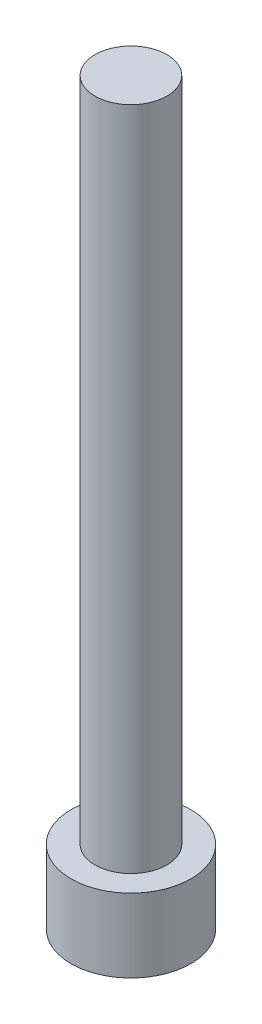
ISO-10303-21;
HEADER;
FILE_DESCRIPTION(('STEP AP214'),'2;1');
FILE_NAME('part.step','',(''),(''),'','','');
FILE_SCHEMA(('AUTOMOTIVE_DESIGN { 1 0 10303 214 1 1 1 1 }'));
ENDSEC;
DATA;
#1=APPLICATION_CONTEXT('core data for automotive mechanical design processes');
#2=APPLICATION_PROTOCOL_DEFINITION('international standard','automotive_design',2000,#1);
#3=PRODUCT_CONTEXT('',#1,'mechanical');
#4=PRODUCT('Part','Part','',(#3));
#5=PRODUCT_RELATED_PRODUCT_CATEGORY('part','',(#4));
#6=PRODUCT_DEFINITION_FORMATION('','',#4);
#7=PRODUCT_DEFINITION_CONTEXT('part definition',#1,'design');
#8=PRODUCT_DEFINITION('design','',#6,#7);
#9=PRODUCT_DEFINITION_SHAPE('','',#8);
#10=(LENGTH_UNIT() NAMED_UNIT(*) SI_UNIT(.MILLI.,.METRE.));
#11=(NAMED_UNIT(*) PLANE_ANGLE_UNIT() SI_UNIT($,.RADIAN.));
#12=(NAMED_UNIT(*) SI_UNIT($,.STERADIAN.) SOLID_ANGLE_UNIT());
#13=UNCERTAINTY_MEASURE_WITH_UNIT(LENGTH_MEASURE(1.E-05),#10,'distance_accuracy_value','');
#14=(GEOMETRIC_REPRESENTATION_CONTEXT(3) GLOBAL_UNCERTAINTY_ASSIGNED_CONTEXT((#13)) GLOBAL_UNIT_ASSIGNED_CONTEXT((#10,
#11,#12)) REPRESENTATION_CONTEXT('',''));
#15=CARTESIAN_POINT('',(0.,0.,0.));
#16=DIRECTION('',(0.,0.,1.));
#17=DIRECTION('',(1.,0.,0.));
#18=AXIS2_PLACEMENT_3D('',#15,#16,#17);
#19=CARTESIAN_POINT('',(0.,3.5052,0.));
#20=DIRECTION('',(0.,1.,0.));
#21=DIRECTION('',(0.,0.,1.));
#22=AXIS2_PLACEMENT_3D('',#19,#20,#21);
#23=PLANE('',#22);
#24=CARTESIAN_POINT('',(0.,3.5052,0.));
#25=DIRECTION('',(0.,1.,0.));
#26=DIRECTION('',(0.,0.,1.));
#27=AXIS2_PLACEMENT_3D('',#24,#25,#26);
#28=CIRCLE('',#27,2.8575);
#29=CARTESIAN_POINT('',(0.,3.5052,2.8575));
#30=VERTEX_POINT('',#29);
#31=EDGE_CURVE('E11',#30,#30,#28,.T.);
#32=ORIENTED_EDGE('',*,*,#31,.T.);
#33=EDGE_LOOP('',(#32));
#34=FACE_BOUND('',#33,.T.);
#35=CARTESIAN_POINT('',(0.,3.5052,0.));
#36=DIRECTION('',(0.,1.,0.));
#37=DIRECTION('',(0.,0.,1.));
#38=AXIS2_PLACEMENT_3D('',#35,#36,#37);
#39=CIRCLE('',#38,1.7145);
#40=CARTESIAN_POINT('',(0.,3.5052,1.7145));
#41=VERTEX_POINT('',#40);
#42=EDGE_CURVE('E152',#41,#41,#39,.T.);
#43=ORIENTED_EDGE('',*,*,#42,.F.);
#44=EDGE_LOOP('',(#43));
#45=FACE_BOUND('',#44,.T.);
#46=ADVANCED_FACE('F33',(#34,#45),#23,.T.);
#47=CARTESIAN_POINT('',(0.,3.5052,0.));
#48=DIRECTION('',(0.,-1.,0.));
#49=DIRECTION('',(0.,0.,-1.));
#50=AXIS2_PLACEMENT_3D('',#47,#48,#49);
#51=CYLINDRICAL_SURFACE('',#50,2.8575);
#52=ORIENTED_EDGE('',*,*,#31,.F.);
#53=EDGE_LOOP('',(#52));
#54=FACE_BOUND('',#53,.T.);
#55=CARTESIAN_POINT('',(0.,0.,0.));
#56=DIRECTION('',(0.,1.,0.));
#57=DIRECTION('',(0.,0.,1.));
#58=AXIS2_PLACEMENT_3D('',#55,#56,#57);
#59=CIRCLE('',#58,2.8575);
#60=CARTESIAN_POINT('',(0.,0.,2.8575));
#61=VERTEX_POINT('',#60);
#62=EDGE_CURVE('E37',#61,#61,#59,.T.);
#63=ORIENTED_EDGE('',*,*,#62,.T.);
#64=EDGE_LOOP('',(#63));
#65=FACE_BOUND('',#64,.T.);
#66=ADVANCED_FACE('F35',(#54,#65),#51,.T.);
#67=CARTESIAN_POINT('',(0.,0.,0.));
#68=DIRECTION('',(0.,1.,0.));
#69=DIRECTION('',(0.,0.,1.));
#70=AXIS2_PLACEMENT_3D('',#67,#68,#69);
#71=PLANE('',#70);
#72=DIRECTION('',(-0.500000000000001,0.,0.866025403784438));
#73=VECTOR('',#72,1.);
#74=CARTESIAN_POINT('',(1.60395121659243,0.,0.));
#75=LINE('',#74,#73);
#76=CARTESIAN_POINT('',(1.60395121659243,0.,0.));
#77=VERTEX_POINT('',#76);
#78=CARTESIAN_POINT('',(0.801975608296214,0.,1.3890625));
#79=VERTEX_POINT('',#78);
#80=EDGE_CURVE('E122',#77,#79,#75,.T.);
#81=ORIENTED_EDGE('',*,*,#80,.F.);
#82=DIRECTION('',(0.5,0.,0.866025403784439));
#83=VECTOR('',#82,1.);
#84=CARTESIAN_POINT('',(0.801975608296215,0.,-1.3890625));
#85=LINE('',#84,#83);
#86=CARTESIAN_POINT('',(0.801975608296215,0.,-1.3890625));
#87=VERTEX_POINT('',#86);
#88=EDGE_CURVE('E48',#87,#77,#85,.T.);
#89=ORIENTED_EDGE('',*,*,#88,.F.);
#90=DIRECTION('',(1.,0.,0.));
#91=VECTOR('',#90,1.);
#92=CARTESIAN_POINT('',(-0.801975608296214,0.,-1.3890625));
#93=LINE('',#92,#91);
#94=CARTESIAN_POINT('',(-0.801975608296214,0.,-1.3890625));
#95=VERTEX_POINT('',#94);
#96=EDGE_CURVE('E132',#95,#87,#93,.T.);
#97=ORIENTED_EDGE('',*,*,#96,.F.);
#98=DIRECTION('',(0.5,0.,-0.866025403784438));
#99=VECTOR('',#98,1.);
#100=CARTESIAN_POINT('',(-1.60395121659243,0.,0.));
#101=LINE('',#100,#99);
#102=CARTESIAN_POINT('',(-1.60395121659243,0.,0.));
#103=VERTEX_POINT('',#102);
#104=EDGE_CURVE('E130',#103,#95,#101,.T.);
#105=ORIENTED_EDGE('',*,*,#104,.F.);
#106=DIRECTION('',(-0.5,0.,-0.866025403784439));
#107=VECTOR('',#106,1.);
#108=CARTESIAN_POINT('',(-0.801975608296214,0.,1.3890625));
#109=LINE('',#108,#107);
#110=CARTESIAN_POINT('',(-0.801975608296214,0.,1.3890625));
#111=VERTEX_POINT('',#110);
#112=EDGE_CURVE('E96',#111,#103,#109,.T.);
#113=ORIENTED_EDGE('',*,*,#112,.F.);
#114=DIRECTION('',(-1.,0.,0.));
#115=VECTOR('',#114,1.);
#116=CARTESIAN_POINT('',(0.801975608296214,0.,1.3890625));
#117=LINE('',#116,#115);
#118=EDGE_CURVE('E126',#79,#111,#117,.T.);
#119=ORIENTED_EDGE('',*,*,#118,.F.);
#120=EDGE_LOOP('',(#81,#89,#97,#105,#113,#119));
#121=FACE_BOUND('',#120,.T.);
#122=ORIENTED_EDGE('',*,*,#62,.F.);
#123=EDGE_LOOP('',(#122));
#124=FACE_BOUND('',#123,.T.);
#125=ADVANCED_FACE('F145',(#121,#124),#71,.F.);
#126=CARTESIAN_POINT('',(0.801975608296215,1.9558,-1.3890625));
#127=DIRECTION('',(0.866025403784438,0.,-0.5));
#128=DIRECTION('',(-0.5,0.,-0.866025403784439));
#129=AXIS2_PLACEMENT_3D('',#126,#127,#128);
#130=PLANE('',#129);
#131=ORIENTED_EDGE('',*,*,#88,.T.);
#132=DIRECTION('',(0.,-1.,0.));
#133=VECTOR('',#132,1.);
#134=CARTESIAN_POINT('',(1.60395121659243,1.9558,0.));
#135=LINE('',#134,#133);
#136=CARTESIAN_POINT('',(1.60395121659243,1.9558,0.));
#137=VERTEX_POINT('',#136);
#138=EDGE_CURVE('E78',#137,#77,#135,.T.);
#139=ORIENTED_EDGE('',*,*,#138,.F.);
#140=DIRECTION('',(0.5,0.,0.866025403784439));
#141=VECTOR('',#140,1.);
#142=CARTESIAN_POINT('',(0.801975608296215,1.9558,-1.3890625));
#143=LINE('',#142,#141);
#144=CARTESIAN_POINT('',(0.801975608296215,1.9558,-1.3890625));
#145=VERTEX_POINT('',#144);
#146=EDGE_CURVE('E134',#145,#137,#143,.T.);
#147=ORIENTED_EDGE('',*,*,#146,.F.);
#148=DIRECTION('',(0.,-1.,0.));
#149=VECTOR('',#148,1.);
#150=CARTESIAN_POINT('',(0.801975608296215,1.9558,-1.3890625));
#151=LINE('',#150,#149);
#152=EDGE_CURVE('E56',#145,#87,#151,.T.);
#153=ORIENTED_EDGE('',*,*,#152,.T.);
#154=EDGE_LOOP('',(#131,#139,#147,#153));
#155=FACE_BOUND('',#154,.T.);
#156=ADVANCED_FACE('F174',(#155),#130,.F.);
#157=CARTESIAN_POINT('',(-0.801975608296214,1.9558,-1.3890625));
#158=DIRECTION('',(0.,0.,-1.));
#159=DIRECTION('',(-1.,0.,0.));
#160=AXIS2_PLACEMENT_3D('',#157,#158,#159);
#161=PLANE('',#160);
#162=ORIENTED_EDGE('',*,*,#96,.T.);
#163=ORIENTED_EDGE('',*,*,#152,.F.);
#164=DIRECTION('',(1.,0.,0.));
#165=VECTOR('',#164,1.);
#166=CARTESIAN_POINT('',(-0.801975608296214,1.9558,-1.3890625));
#167=LINE('',#166,#165);
#168=CARTESIAN_POINT('',(-0.801975608296214,1.9558,-1.3890625));
#169=VERTEX_POINT('',#168);
#170=EDGE_CURVE('E108',#169,#145,#167,.T.);
#171=ORIENTED_EDGE('',*,*,#170,.F.);
#172=DIRECTION('',(0.,-1.,0.));
#173=VECTOR('',#172,1.);
#174=CARTESIAN_POINT('',(-0.801975608296214,1.9558,-1.3890625));
#175=LINE('',#174,#173);
#176=EDGE_CURVE('E100',#169,#95,#175,.T.);
#177=ORIENTED_EDGE('',*,*,#176,.T.);
#178=EDGE_LOOP('',(#162,#163,#171,#177));
#179=FACE_BOUND('',#178,.T.);
#180=ADVANCED_FACE('F180',(#179),#161,.F.);
#181=CARTESIAN_POINT('',(-1.60395121659243,1.9558,0.));
#182=DIRECTION('',(-0.866025403784438,0.,-0.5));
#183=DIRECTION('',(-0.5,0.,0.866025403784439));
#184=AXIS2_PLACEMENT_3D('',#181,#182,#183);
#185=PLANE('',#184);
#186=ORIENTED_EDGE('',*,*,#104,.T.);
#187=ORIENTED_EDGE('',*,*,#176,.F.);
#188=DIRECTION('',(0.5,0.,-0.866025403784438));
#189=VECTOR('',#188,1.);
#190=CARTESIAN_POINT('',(-1.60395121659243,1.9558,0.));
#191=LINE('',#190,#189);
#192=CARTESIAN_POINT('',(-1.60395121659243,1.9558,0.));
#193=VERTEX_POINT('',#192);
#194=EDGE_CURVE('E104',#193,#169,#191,.T.);
#195=ORIENTED_EDGE('',*,*,#194,.F.);
#196=DIRECTION('',(0.,-1.,0.));
#197=VECTOR('',#196,1.);
#198=CARTESIAN_POINT('',(-1.60395121659243,1.9558,0.));
#199=LINE('',#198,#197);
#200=EDGE_CURVE('E89',#193,#103,#199,.T.);
#201=ORIENTED_EDGE('',*,*,#200,.T.);
#202=EDGE_LOOP('',(#186,#187,#195,#201));
#203=FACE_BOUND('',#202,.T.);
#204=ADVANCED_FACE('F105',(#203),#185,.F.);
#205=CARTESIAN_POINT('',(-0.801975608296214,1.9558,1.3890625));
#206=DIRECTION('',(-0.866025403784439,0.,0.5));
#207=DIRECTION('',(0.5,0.,0.866025403784439));
#208=AXIS2_PLACEMENT_3D('',#205,#206,#207);
#209=PLANE('',#208);
#210=ORIENTED_EDGE('',*,*,#112,.T.);
#211=ORIENTED_EDGE('',*,*,#200,.F.);
#212=DIRECTION('',(-0.5,0.,-0.866025403784439));
#213=VECTOR('',#212,1.);
#214=CARTESIAN_POINT('',(-0.801975608296214,1.9558,1.3890625));
#215=LINE('',#214,#213);
#216=CARTESIAN_POINT('',(-0.801975608296214,1.9558,1.3890625));
#217=VERTEX_POINT('',#216);
#218=EDGE_CURVE('E93',#217,#193,#215,.T.);
#219=ORIENTED_EDGE('',*,*,#218,.F.);
#220=DIRECTION('',(0.,-1.,0.));
#221=VECTOR('',#220,1.);
#222=CARTESIAN_POINT('',(-0.801975608296214,1.9558,1.3890625));
#223=LINE('',#222,#221);
#224=EDGE_CURVE('E101',#217,#111,#223,.T.);
#225=ORIENTED_EDGE('',*,*,#224,.T.);
#226=EDGE_LOOP('',(#210,#211,#219,#225));
#227=FACE_BOUND('',#226,.T.);
#228=ADVANCED_FACE('F91',(#227),#209,.F.);
#229=CARTESIAN_POINT('',(0.801975608296214,1.9558,1.3890625));
#230=DIRECTION('',(0.,0.,1.));
#231=DIRECTION('',(1.,0.,0.));
#232=AXIS2_PLACEMENT_3D('',#229,#230,#231);
#233=PLANE('',#232);
#234=ORIENTED_EDGE('',*,*,#118,.T.);
#235=ORIENTED_EDGE('',*,*,#224,.F.);
#236=DIRECTION('',(-1.,0.,0.));
#237=VECTOR('',#236,1.);
#238=CARTESIAN_POINT('',(0.801975608296214,1.9558,1.3890625));
#239=LINE('',#238,#237);
#240=CARTESIAN_POINT('',(0.801975608296214,1.9558,1.3890625));
#241=VERTEX_POINT('',#240);
#242=EDGE_CURVE('E114',#241,#217,#239,.T.);
#243=ORIENTED_EDGE('',*,*,#242,.F.);
#244=DIRECTION('',(0.,-1.,0.));
#245=VECTOR('',#244,1.);
#246=CARTESIAN_POINT('',(0.801975608296214,1.9558,1.3890625));
#247=LINE('',#246,#245);
#248=EDGE_CURVE('E138',#241,#79,#247,.T.);
#249=ORIENTED_EDGE('',*,*,#248,.T.);
#250=EDGE_LOOP('',(#234,#235,#243,#249));
#251=FACE_BOUND('',#250,.T.);
#252=ADVANCED_FACE('F149',(#251),#233,.F.);
#253=CARTESIAN_POINT('',(1.60395121659243,1.9558,0.));
#254=DIRECTION('',(0.866025403784438,0.,0.500000000000001));
#255=DIRECTION('',(0.500000000000001,0.,-0.866025403784438));
#256=AXIS2_PLACEMENT_3D('',#253,#254,#255);
#257=PLANE('',#256);
#258=ORIENTED_EDGE('',*,*,#80,.T.);
#259=ORIENTED_EDGE('',*,*,#248,.F.);
#260=DIRECTION('',(-0.500000000000001,0.,0.866025403784438));
#261=VECTOR('',#260,1.);
#262=CARTESIAN_POINT('',(1.60395121659243,1.9558,0.));
#263=LINE('',#262,#261);
#264=EDGE_CURVE('E116',#137,#241,#263,.T.);
#265=ORIENTED_EDGE('',*,*,#264,.F.);
#266=ORIENTED_EDGE('',*,*,#138,.T.);
#267=EDGE_LOOP('',(#258,#259,#265,#266));
#268=FACE_BOUND('',#267,.T.);
#269=ADVANCED_FACE('F142',(#268),#257,.F.);
#270=CARTESIAN_POINT('',(0.,1.9558,0.));
#271=DIRECTION('',(0.,-1.,0.));
#272=DIRECTION('',(0.,0.,-1.));
#273=AXIS2_PLACEMENT_3D('',#270,#271,#272);
#274=PLANE('',#273);
#275=ORIENTED_EDGE('',*,*,#146,.T.);
#276=ORIENTED_EDGE('',*,*,#264,.T.);
#277=ORIENTED_EDGE('',*,*,#242,.T.);
#278=ORIENTED_EDGE('',*,*,#218,.T.);
#279=ORIENTED_EDGE('',*,*,#194,.T.);
#280=ORIENTED_EDGE('',*,*,#170,.T.);
#281=EDGE_LOOP('',(#275,#276,#277,#278,#279,#280));
#282=FACE_BOUND('',#281,.T.);
#283=ADVANCED_FACE('F111',(#282),#274,.T.);
#284=CARTESIAN_POINT('',(0.,35.2552,0.));
#285=DIRECTION('',(0.,-1.,0.));
#286=DIRECTION('',(0.,0.,-1.));
#287=AXIS2_PLACEMENT_3D('',#284,#285,#286);
#288=CYLINDRICAL_SURFACE('',#287,1.7145);
#289=CARTESIAN_POINT('',(0.,35.2552,0.));
#290=DIRECTION('',(0.,1.,0.));
#291=DIRECTION('',(0.,0.,1.));
#292=AXIS2_PLACEMENT_3D('',#289,#290,#291);
#293=CIRCLE('',#292,1.7145);
#294=CARTESIAN_POINT('',(0.,35.2552,1.7145));
#295=VERTEX_POINT('',#294);
#296=EDGE_CURVE('E123',#295,#295,#293,.T.);
#297=ORIENTED_EDGE('',*,*,#296,.F.);
#298=EDGE_LOOP('',(#297));
#299=FACE_BOUND('',#298,.T.);
#300=ORIENTED_EDGE('',*,*,#42,.T.);
#301=EDGE_LOOP('',(#300));
#302=FACE_BOUND('',#301,.T.);
#303=ADVANCED_FACE('F160',(#299,#302),#288,.T.);
#304=CARTESIAN_POINT('',(0.,35.2552,0.));
#305=DIRECTION('',(0.,1.,0.));
#306=DIRECTION('',(0.,0.,1.));
#307=AXIS2_PLACEMENT_3D('',#304,#305,#306);
#308=PLANE('',#307);
#309=ORIENTED_EDGE('',*,*,#296,.T.);
#310=EDGE_LOOP('',(#309));
#311=FACE_BOUND('',#310,.T.);
#312=ADVANCED_FACE('F158',(#311),#308,.T.);
#313=CLOSED_SHELL('',(#46,#66,#125,#156,#180,#204,#228,#252,#269,#283,#303,#312));
#314=MANIFOLD_SOLID_BREP('B2',#313);
#315=ADVANCED_BREP_SHAPE_REPRESENTATION('',(#18,#314),#14);
#316=SHAPE_DEFINITION_REPRESENTATION(#9,#315);
ENDSEC;
END-ISO-10303-21;
